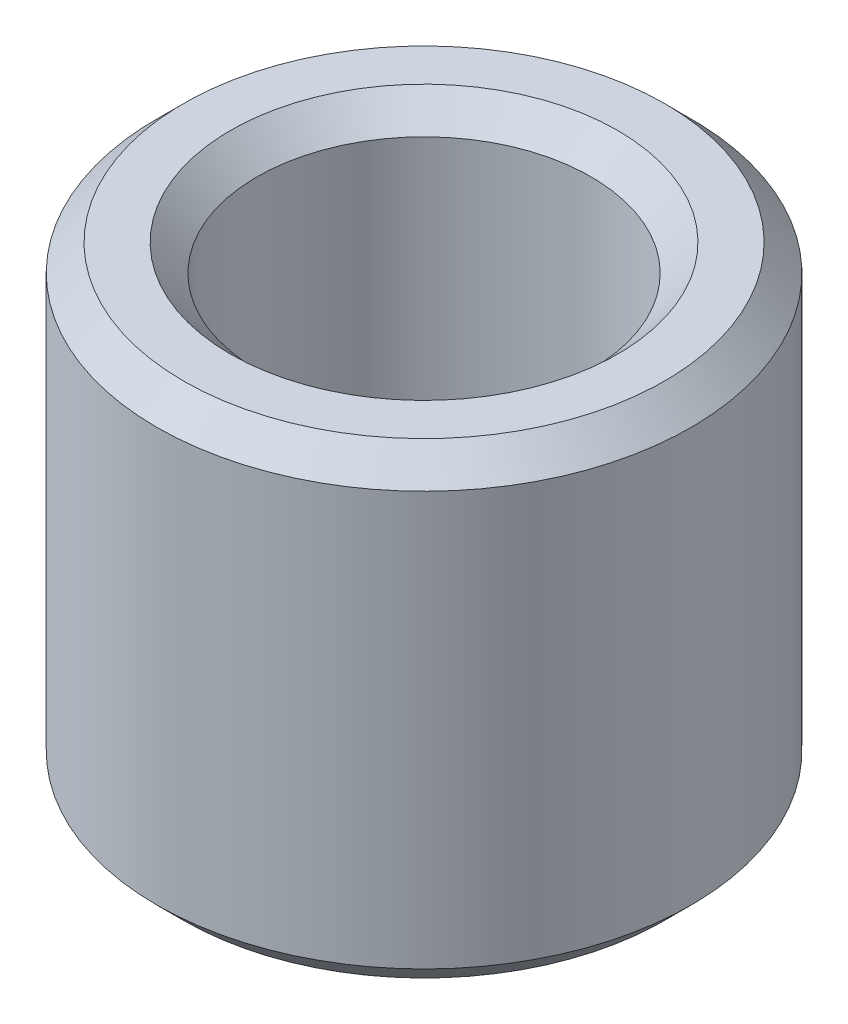
ISO-10303-21;
HEADER;
FILE_DESCRIPTION(('STEP AP214'),'2;1');
FILE_NAME('part.step','',(''),(''),'','','');
FILE_SCHEMA(('AUTOMOTIVE_DESIGN { 1 0 10303 214 1 1 1 1 }'));
ENDSEC;
DATA;
#1=APPLICATION_CONTEXT('core data for automotive mechanical design processes');
#2=APPLICATION_PROTOCOL_DEFINITION('international standard','automotive_design',2000,#1);
#3=PRODUCT_CONTEXT('',#1,'mechanical');
#4=PRODUCT('Part','Part','',(#3));
#5=PRODUCT_RELATED_PRODUCT_CATEGORY('part','',(#4));
#6=PRODUCT_DEFINITION_FORMATION('','',#4);
#7=PRODUCT_DEFINITION_CONTEXT('part definition',#1,'design');
#8=PRODUCT_DEFINITION('design','',#6,#7);
#9=PRODUCT_DEFINITION_SHAPE('','',#8);
#10=(LENGTH_UNIT() NAMED_UNIT(*) SI_UNIT(.MILLI.,.METRE.));
#11=(NAMED_UNIT(*) PLANE_ANGLE_UNIT() SI_UNIT($,.RADIAN.));
#12=(NAMED_UNIT(*) SI_UNIT($,.STERADIAN.) SOLID_ANGLE_UNIT());
#13=UNCERTAINTY_MEASURE_WITH_UNIT(LENGTH_MEASURE(1.E-05),#10,'distance_accuracy_value','');
#14=(GEOMETRIC_REPRESENTATION_CONTEXT(3) GLOBAL_UNCERTAINTY_ASSIGNED_CONTEXT((#13)) GLOBAL_UNIT_ASSIGNED_CONTEXT((#10,
#11,#12)) REPRESENTATION_CONTEXT('',''));
#15=CARTESIAN_POINT('',(0.,0.,0.));
#16=DIRECTION('',(0.,0.,1.));
#17=DIRECTION('',(1.,0.,0.));
#18=AXIS2_PLACEMENT_3D('',#15,#16,#17);
#19=CARTESIAN_POINT('',(0.,3.497,0.));
#20=DIRECTION('',(0.,1.,0.));
#21=DIRECTION('',(0.,0.,1.));
#22=AXIS2_PLACEMENT_3D('',#19,#20,#21);
#23=PLANE('',#22);
#24=CARTESIAN_POINT('',(0.,3.497,0.));
#25=DIRECTION('',(0.,1.,0.));
#26=DIRECTION('',(0.,0.,1.));
#27=AXIS2_PLACEMENT_3D('',#24,#25,#26);
#28=CIRCLE('',#27,1.45);
#29=CARTESIAN_POINT('',(0.,3.497,1.45));
#30=VERTEX_POINT('',#29);
#31=EDGE_CURVE('E59',#30,#30,#28,.F.);
#32=ORIENTED_EDGE('',*,*,#31,.T.);
#33=EDGE_LOOP('',(#32));
#34=FACE_BOUND('',#33,.T.);
#35=CARTESIAN_POINT('',(0.,3.497,0.));
#36=DIRECTION('',(0.,1.,0.));
#37=DIRECTION('',(0.,0.,1.));
#38=AXIS2_PLACEMENT_3D('',#35,#36,#37);
#39=CIRCLE('',#38,1.8);
#40=CARTESIAN_POINT('',(0.,3.497,1.8));
#41=VERTEX_POINT('',#40);
#42=EDGE_CURVE('E64',#41,#41,#39,.T.);
#43=ORIENTED_EDGE('',*,*,#42,.T.);
#44=EDGE_LOOP('',(#43));
#45=FACE_BOUND('',#44,.T.);
#46=ADVANCED_FACE('F45',(#34,#45),#23,.T.);
#47=CARTESIAN_POINT('',(0.,0.,0.));
#48=DIRECTION('',(0.,1.,0.));
#49=DIRECTION('',(0.,0.,1.));
#50=AXIS2_PLACEMENT_3D('',#47,#48,#49);
#51=PLANE('',#50);
#52=CARTESIAN_POINT('',(0.,0.,0.));
#53=DIRECTION('',(0.,1.,0.));
#54=DIRECTION('',(0.,0.,1.));
#55=AXIS2_PLACEMENT_3D('',#52,#53,#54);
#56=CIRCLE('',#55,1.45);
#57=CARTESIAN_POINT('',(0.,0.,1.45));
#58=VERTEX_POINT('',#57);
#59=EDGE_CURVE('E78',#58,#58,#56,.T.);
#60=ORIENTED_EDGE('',*,*,#59,.T.);
#61=EDGE_LOOP('',(#60));
#62=FACE_BOUND('',#61,.T.);
#63=CARTESIAN_POINT('',(0.,0.,0.));
#64=DIRECTION('',(0.,1.,0.));
#65=DIRECTION('',(0.,0.,1.));
#66=AXIS2_PLACEMENT_3D('',#63,#64,#65);
#67=CIRCLE('',#66,1.8);
#68=CARTESIAN_POINT('',(0.,0.,1.8));
#69=VERTEX_POINT('',#68);
#70=EDGE_CURVE('E82',#69,#69,#67,.F.);
#71=ORIENTED_EDGE('',*,*,#70,.T.);
#72=EDGE_LOOP('',(#71));
#73=FACE_BOUND('',#72,.T.);
#74=ADVANCED_FACE('F87',(#62,#73),#51,.F.);
#75=CARTESIAN_POINT('',(0.,3.497,0.));
#76=DIRECTION('',(0.,-1.,0.));
#77=DIRECTION('',(0.,0.,-1.));
#78=AXIS2_PLACEMENT_3D('',#75,#76,#77);
#79=CYLINDRICAL_SURFACE('',#78,2.);
#80=CARTESIAN_POINT('',(0.,0.199999999999999,0.));
#81=DIRECTION('',(0.,1.,0.));
#82=DIRECTION('',(0.,0.,1.));
#83=AXIS2_PLACEMENT_3D('',#80,#81,#82);
#84=CIRCLE('',#83,2.);
#85=CARTESIAN_POINT('',(0.,0.199999999999999,2.));
#86=VERTEX_POINT('',#85);
#87=EDGE_CURVE('E10',#86,#86,#84,.T.);
#88=ORIENTED_EDGE('',*,*,#87,.T.);
#89=EDGE_LOOP('',(#88));
#90=FACE_BOUND('',#89,.T.);
#91=CARTESIAN_POINT('',(0.,3.297,0.));
#92=DIRECTION('',(0.,1.,0.));
#93=DIRECTION('',(0.,0.,1.));
#94=AXIS2_PLACEMENT_3D('',#91,#92,#93);
#95=CIRCLE('',#94,2.);
#96=CARTESIAN_POINT('',(0.,3.297,2.));
#97=VERTEX_POINT('',#96);
#98=EDGE_CURVE('E54',#97,#97,#95,.F.);
#99=ORIENTED_EDGE('',*,*,#98,.T.);
#100=EDGE_LOOP('',(#99));
#101=FACE_BOUND('',#100,.T.);
#102=ADVANCED_FACE('F108',(#90,#101),#79,.T.);
#103=CARTESIAN_POINT('',(0.,3.497,0.));
#104=DIRECTION('',(0.,-1.,0.));
#105=DIRECTION('',(0.,0.,-1.));
#106=AXIS2_PLACEMENT_3D('',#103,#104,#105);
#107=CYLINDRICAL_SURFACE('',#106,1.25);
#108=CARTESIAN_POINT('',(0.,0.2,0.));
#109=DIRECTION('',(0.,1.,0.));
#110=DIRECTION('',(0.,0.,1.));
#111=AXIS2_PLACEMENT_3D('',#108,#109,#110);
#112=CIRCLE('',#111,1.25);
#113=CARTESIAN_POINT('',(0.,0.2,1.25));
#114=VERTEX_POINT('',#113);
#115=EDGE_CURVE('E70',#114,#114,#112,.F.);
#116=ORIENTED_EDGE('',*,*,#115,.T.);
#117=EDGE_LOOP('',(#116));
#118=FACE_BOUND('',#117,.T.);
#119=CARTESIAN_POINT('',(0.,3.297,0.));
#120=DIRECTION('',(0.,1.,0.));
#121=DIRECTION('',(0.,0.,1.));
#122=AXIS2_PLACEMENT_3D('',#119,#120,#121);
#123=CIRCLE('',#122,1.25);
#124=CARTESIAN_POINT('',(0.,3.297,1.25));
#125=VERTEX_POINT('',#124);
#126=EDGE_CURVE('E74',#125,#125,#123,.T.);
#127=ORIENTED_EDGE('',*,*,#126,.T.);
#128=EDGE_LOOP('',(#127));
#129=FACE_BOUND('',#128,.T.);
#130=ADVANCED_FACE('F113',(#118,#129),#107,.F.);
#131=CARTESIAN_POINT('',(0.,0.,0.));
#132=DIRECTION('',(0.,-1.,0.));
#133=DIRECTION('',(0.,0.,-1.));
#134=AXIS2_PLACEMENT_3D('',#131,#132,#133);
#135=CONICAL_SURFACE('',#134,1.45,0.785398163397447);
#136=ORIENTED_EDGE('',*,*,#115,.F.);
#137=EDGE_LOOP('',(#136));
#138=FACE_BOUND('',#137,.T.);
#139=ORIENTED_EDGE('',*,*,#59,.F.);
#140=EDGE_LOOP('',(#139));
#141=FACE_BOUND('',#140,.T.);
#142=ADVANCED_FACE('F98',(#138,#141),#135,.F.);
#143=CARTESIAN_POINT('',(0.,3.297,0.));
#144=DIRECTION('',(0.,1.,0.));
#145=DIRECTION('',(0.,0.,1.));
#146=AXIS2_PLACEMENT_3D('',#143,#144,#145);
#147=CONICAL_SURFACE('',#146,1.25,0.785398163397451);
#148=ORIENTED_EDGE('',*,*,#31,.F.);
#149=EDGE_LOOP('',(#148));
#150=FACE_BOUND('',#149,.T.);
#151=ORIENTED_EDGE('',*,*,#126,.F.);
#152=EDGE_LOOP('',(#151));
#153=FACE_BOUND('',#152,.T.);
#154=ADVANCED_FACE('F92',(#150,#153),#147,.F.);
#155=CARTESIAN_POINT('',(0.,0.199999999999999,0.));
#156=DIRECTION('',(0.,1.,0.));
#157=DIRECTION('',(0.,0.,1.));
#158=AXIS2_PLACEMENT_3D('',#155,#156,#157);
#159=CONICAL_SURFACE('',#158,2.,0.785398163397449);
#160=ORIENTED_EDGE('',*,*,#70,.F.);
#161=EDGE_LOOP('',(#160));
#162=FACE_BOUND('',#161,.T.);
#163=ORIENTED_EDGE('',*,*,#87,.F.);
#164=EDGE_LOOP('',(#163));
#165=FACE_BOUND('',#164,.T.);
#166=ADVANCED_FACE('F89',(#162,#165),#159,.T.);
#167=CARTESIAN_POINT('',(0.,3.497,0.));
#168=DIRECTION('',(0.,-1.,0.));
#169=DIRECTION('',(0.,0.,-1.));
#170=AXIS2_PLACEMENT_3D('',#167,#168,#169);
#171=CONICAL_SURFACE('',#170,1.8,0.785398163397445);
#172=ORIENTED_EDGE('',*,*,#98,.F.);
#173=EDGE_LOOP('',(#172));
#174=FACE_BOUND('',#173,.T.);
#175=ORIENTED_EDGE('',*,*,#42,.F.);
#176=EDGE_LOOP('',(#175));
#177=FACE_BOUND('',#176,.T.);
#178=ADVANCED_FACE('F48',(#174,#177),#171,.T.);
#179=CLOSED_SHELL('',(#46,#74,#102,#130,#142,#154,#166,#178));
#180=MANIFOLD_SOLID_BREP('B2',#179);
#181=ADVANCED_BREP_SHAPE_REPRESENTATION('',(#18,#180),#14);
#182=SHAPE_DEFINITION_REPRESENTATION(#9,#181);
ENDSEC;
END-ISO-10303-21;
